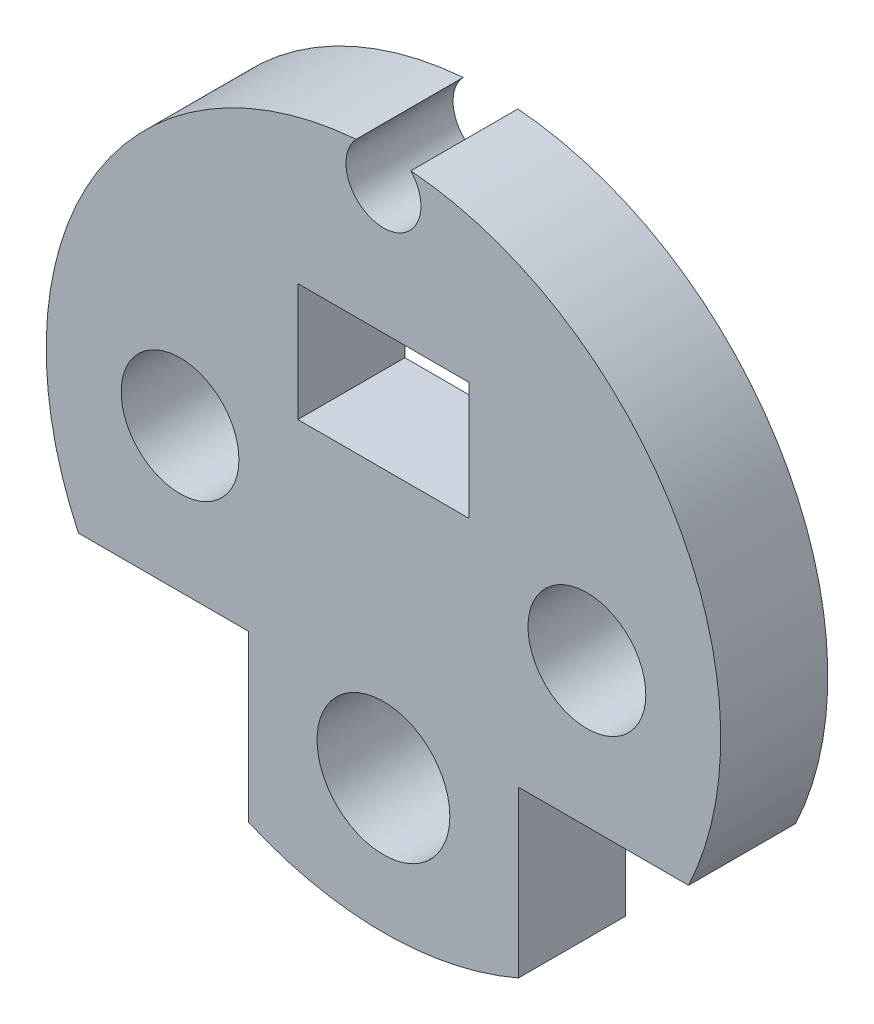
ISO-10303-21;
HEADER;
FILE_DESCRIPTION(('STEP AP214'),'2;1');
FILE_NAME('part.step','',(''),(''),'','','');
FILE_SCHEMA(('AUTOMOTIVE_DESIGN { 1 0 10303 214 1 1 1 1 }'));
ENDSEC;
DATA;
#1=APPLICATION_CONTEXT('core data for automotive mechanical design processes');
#2=APPLICATION_PROTOCOL_DEFINITION('international standard','automotive_design',2000,#1);
#3=PRODUCT_CONTEXT('',#1,'mechanical');
#4=PRODUCT('Part','Part','',(#3));
#5=PRODUCT_RELATED_PRODUCT_CATEGORY('part','',(#4));
#6=PRODUCT_DEFINITION_FORMATION('','',#4);
#7=PRODUCT_DEFINITION_CONTEXT('part definition',#1,'design');
#8=PRODUCT_DEFINITION('design','',#6,#7);
#9=PRODUCT_DEFINITION_SHAPE('','',#8);
#10=(LENGTH_UNIT() NAMED_UNIT(*) SI_UNIT(.MILLI.,.METRE.));
#11=(NAMED_UNIT(*) PLANE_ANGLE_UNIT() SI_UNIT($,.RADIAN.));
#12=(NAMED_UNIT(*) SI_UNIT($,.STERADIAN.) SOLID_ANGLE_UNIT());
#13=UNCERTAINTY_MEASURE_WITH_UNIT(LENGTH_MEASURE(1.E-05),#10,'distance_accuracy_value','');
#14=(GEOMETRIC_REPRESENTATION_CONTEXT(3) GLOBAL_UNCERTAINTY_ASSIGNED_CONTEXT((#13)) GLOBAL_UNIT_ASSIGNED_CONTEXT((#10,
#11,#12)) REPRESENTATION_CONTEXT('',''));
#15=CARTESIAN_POINT('',(0.,0.,0.));
#16=DIRECTION('',(0.,0.,1.));
#17=DIRECTION('',(1.,0.,0.));
#18=AXIS2_PLACEMENT_3D('',#15,#16,#17);
#19=CARTESIAN_POINT('',(0.,0.,5.));
#20=DIRECTION('',(0.,0.,-1.));
#21=DIRECTION('',(-1.,0.,0.));
#22=AXIS2_PLACEMENT_3D('',#19,#20,#21);
#23=CYLINDRICAL_SURFACE('',#22,15.75);
#24=DIRECTION('',(0.,0.,1.));
#25=VECTOR('',#24,1.);
#26=CARTESIAN_POINT('',(6.30417815305591,-14.4332892236847,0.));
#27=LINE('',#26,#25);
#28=CARTESIAN_POINT('',(6.30417815305591,-14.4332892236847,0.));
#29=VERTEX_POINT('',#28);
#30=CARTESIAN_POINT('',(6.30417815305591,-14.4332892236847,5.));
#31=VERTEX_POINT('',#30);
#32=EDGE_CURVE('E197',#29,#31,#27,.T.);
#33=ORIENTED_EDGE('',*,*,#32,.T.);
#34=CARTESIAN_POINT('',(0.,0.,5.));
#35=DIRECTION('',(0.,0.,1.));
#36=DIRECTION('',(1.,0.,0.));
#37=AXIS2_PLACEMENT_3D('',#34,#35,#36);
#38=CIRCLE('',#37,15.75);
#39=CARTESIAN_POINT('',(-6.30417815305591,-14.4332892236847,5.));
#40=VERTEX_POINT('',#39);
#41=EDGE_CURVE('E279',#40,#31,#38,.T.);
#42=ORIENTED_EDGE('',*,*,#41,.F.);
#43=DIRECTION('',(0.,0.,1.));
#44=VECTOR('',#43,1.);
#45=CARTESIAN_POINT('',(-6.30417815305591,-14.4332892236847,0.));
#46=LINE('',#45,#44);
#47=CARTESIAN_POINT('',(-6.30417815305591,-14.4332892236847,0.));
#48=VERTEX_POINT('',#47);
#49=EDGE_CURVE('E211',#48,#40,#46,.T.);
#50=ORIENTED_EDGE('',*,*,#49,.F.);
#51=CARTESIAN_POINT('',(0.,0.,0.));
#52=DIRECTION('',(0.,0.,1.));
#53=DIRECTION('',(1.,0.,0.));
#54=AXIS2_PLACEMENT_3D('',#51,#52,#53);
#55=CIRCLE('',#54,15.75);
#56=CARTESIAN_POINT('',(-2.75,-15.5080624192708,0.));
#57=VERTEX_POINT('',#56);
#58=EDGE_CURVE('E275',#48,#57,#55,.T.);
#59=ORIENTED_EDGE('',*,*,#58,.T.);
#60=DIRECTION('',(0.,0.,-1.));
#61=VECTOR('',#60,1.);
#62=CARTESIAN_POINT('',(-2.75,-15.5080624192708,5.));
#63=LINE('',#62,#61);
#64=CARTESIAN_POINT('',(-2.75,-15.5080624192708,2.7));
#65=VERTEX_POINT('',#64);
#66=EDGE_CURVE('E272',#57,#65,#63,.F.);
#67=ORIENTED_EDGE('',*,*,#66,.T.);
#68=CARTESIAN_POINT('',(0.,0.,2.7));
#69=DIRECTION('',(0.,0.,1.));
#70=DIRECTION('',(1.,0.,0.));
#71=AXIS2_PLACEMENT_3D('',#68,#69,#70);
#72=CIRCLE('',#71,15.75);
#73=CARTESIAN_POINT('',(2.75,-15.5080624192708,2.7));
#74=VERTEX_POINT('',#73);
#75=EDGE_CURVE('E44',#65,#74,#72,.T.);
#76=ORIENTED_EDGE('',*,*,#75,.T.);
#77=DIRECTION('',(0.,0.,-1.));
#78=VECTOR('',#77,1.);
#79=CARTESIAN_POINT('',(2.75,-15.5080624192708,5.));
#80=LINE('',#79,#78);
#81=CARTESIAN_POINT('',(2.75,-15.5080624192708,0.));
#82=VERTEX_POINT('',#81);
#83=EDGE_CURVE('E269',#74,#82,#80,.T.);
#84=ORIENTED_EDGE('',*,*,#83,.T.);
#85=EDGE_CURVE('E281',#82,#29,#55,.T.);
#86=ORIENTED_EDGE('',*,*,#85,.T.);
#87=EDGE_LOOP('',(#33,#42,#50,#59,#67,#76,#84,#86));
#88=FACE_BOUND('',#87,.T.);
#89=ADVANCED_FACE('F37',(#88),#23,.T.);
#90=DIRECTION('',(0.,0.,1.));
#91=VECTOR('',#90,1.);
#92=CARTESIAN_POINT('',(14.2466739913557,-6.71526471436738,0.));
#93=LINE('',#92,#91);
#94=CARTESIAN_POINT('',(14.2466739913557,-6.71526471436738,0.));
#95=VERTEX_POINT('',#94);
#96=CARTESIAN_POINT('',(14.2466739913557,-6.71526471436738,5.));
#97=VERTEX_POINT('',#96);
#98=EDGE_CURVE('E192',#95,#97,#93,.T.);
#99=ORIENTED_EDGE('',*,*,#98,.F.);
#100=CARTESIAN_POINT('',(1.27539600061427,15.698275862069,0.));
#101=VERTEX_POINT('',#100);
#102=EDGE_CURVE('E283',#95,#101,#55,.T.);
#103=ORIENTED_EDGE('',*,*,#102,.T.);
#104=DIRECTION('',(0.,0.,1.));
#105=VECTOR('',#104,1.);
#106=CARTESIAN_POINT('',(1.27539600061426,15.698275862069,2.5));
#107=LINE('',#106,#105);
#108=CARTESIAN_POINT('',(1.27539600061426,15.698275862069,5.));
#109=VERTEX_POINT('',#108);
#110=EDGE_CURVE('E245',#101,#109,#107,.T.);
#111=ORIENTED_EDGE('',*,*,#110,.T.);
#112=EDGE_CURVE('E280',#97,#109,#38,.T.);
#113=ORIENTED_EDGE('',*,*,#112,.F.);
#114=EDGE_LOOP('',(#99,#103,#111,#113));
#115=FACE_BOUND('',#114,.T.);
#116=ADVANCED_FACE('F323',(#115),#23,.T.);
#117=CARTESIAN_POINT('',(0.,0.,5.));
#118=DIRECTION('',(0.,0.,1.));
#119=DIRECTION('',(1.,0.,0.));
#120=AXIS2_PLACEMENT_3D('',#117,#118,#119);
#121=PLANE('',#120);
#122=DIRECTION('',(0.,-1.,0.));
#123=VECTOR('',#122,1.);
#124=CARTESIAN_POINT('',(-4.,8.5,5.));
#125=LINE('',#124,#123);
#126=CARTESIAN_POINT('',(-4.,8.5,5.));
#127=VERTEX_POINT('',#126);
#128=CARTESIAN_POINT('',(-4.,3.,5.));
#129=VERTEX_POINT('',#128);
#130=EDGE_CURVE('E51',#127,#129,#125,.T.);
#131=ORIENTED_EDGE('',*,*,#130,.F.);
#132=DIRECTION('',(-1.,0.,0.));
#133=VECTOR('',#132,1.);
#134=CARTESIAN_POINT('',(-4.,8.5,5.));
#135=LINE('',#134,#133);
#136=CARTESIAN_POINT('',(4.,8.5,5.));
#137=VERTEX_POINT('',#136);
#138=EDGE_CURVE('E167',#137,#127,#135,.T.);
#139=ORIENTED_EDGE('',*,*,#138,.F.);
#140=DIRECTION('',(0.,1.,0.));
#141=VECTOR('',#140,1.);
#142=CARTESIAN_POINT('',(4.,8.5,5.));
#143=LINE('',#142,#141);
#144=CARTESIAN_POINT('',(4.,3.,5.));
#145=VERTEX_POINT('',#144);
#146=EDGE_CURVE('E170',#145,#137,#143,.T.);
#147=ORIENTED_EDGE('',*,*,#146,.F.);
#148=DIRECTION('',(1.,0.,0.));
#149=VECTOR('',#148,1.);
#150=CARTESIAN_POINT('',(-4.,3.,5.));
#151=LINE('',#150,#149);
#152=EDGE_CURVE('E176',#129,#145,#151,.T.);
#153=ORIENTED_EDGE('',*,*,#152,.F.);
#154=EDGE_LOOP('',(#131,#139,#147,#153));
#155=FACE_BOUND('',#154,.T.);
#156=CARTESIAN_POINT('',(9.5,0.,5.));
#157=DIRECTION('',(0.,0.,1.));
#158=DIRECTION('',(1.,0.,0.));
#159=AXIS2_PLACEMENT_3D('',#156,#157,#158);
#160=CIRCLE('',#159,2.75);
#161=CARTESIAN_POINT('',(12.25,0.,5.));
#162=VERTEX_POINT('',#161);
#163=EDGE_CURVE('E231',#162,#162,#160,.T.);
#164=ORIENTED_EDGE('',*,*,#163,.F.);
#165=EDGE_LOOP('',(#164));
#166=FACE_BOUND('',#165,.T.);
#167=CARTESIAN_POINT('',(-9.5,0.,5.));
#168=DIRECTION('',(0.,0.,1.));
#169=DIRECTION('',(1.,0.,0.));
#170=AXIS2_PLACEMENT_3D('',#167,#168,#169);
#171=CIRCLE('',#170,2.75);
#172=CARTESIAN_POINT('',(-6.75,0.,5.));
#173=VERTEX_POINT('',#172);
#174=EDGE_CURVE('E225',#173,#173,#171,.T.);
#175=ORIENTED_EDGE('',*,*,#174,.F.);
#176=EDGE_LOOP('',(#175));
#177=FACE_BOUND('',#176,.T.);
#178=CARTESIAN_POINT('',(0.,-9.50000000000001,5.));
#179=DIRECTION('',(0.,0.,1.));
#180=DIRECTION('',(1.,0.,0.));
#181=AXIS2_PLACEMENT_3D('',#178,#179,#180);
#182=CIRCLE('',#181,3.1);
#183=CARTESIAN_POINT('',(3.1,-9.50000000000001,5.));
#184=VERTEX_POINT('',#183);
#185=EDGE_CURVE('E218',#184,#184,#182,.T.);
#186=ORIENTED_EDGE('',*,*,#185,.F.);
#187=EDGE_LOOP('',(#186));
#188=FACE_BOUND('',#187,.T.);
#189=ORIENTED_EDGE('',*,*,#41,.T.);
#190=DIRECTION('',(0.,1.,0.));
#191=VECTOR('',#190,1.);
#192=CARTESIAN_POINT('',(6.30417815305591,-6.71526471436738,5.));
#193=LINE('',#192,#191);
#194=CARTESIAN_POINT('',(6.30417815305591,-6.71526471436738,5.));
#195=VERTEX_POINT('',#194);
#196=EDGE_CURVE('E189',#31,#195,#193,.T.);
#197=ORIENTED_EDGE('',*,*,#196,.T.);
#198=DIRECTION('',(1.,0.,0.));
#199=VECTOR('',#198,1.);
#200=CARTESIAN_POINT('',(14.2466739913557,-6.71526471436738,5.));
#201=LINE('',#200,#199);
#202=EDGE_CURVE('E182',#195,#97,#201,.T.);
#203=ORIENTED_EDGE('',*,*,#202,.T.);
#204=ORIENTED_EDGE('',*,*,#112,.T.);
#205=CARTESIAN_POINT('',(0.,14.5,5.));
#206=DIRECTION('',(0.,0.,1.));
#207=DIRECTION('',(1.,0.,0.));
#208=AXIS2_PLACEMENT_3D('',#205,#206,#207);
#209=CIRCLE('',#208,1.75);
#210=CARTESIAN_POINT('',(-1.27539600061427,15.698275862069,5.));
#211=VERTEX_POINT('',#210);
#212=EDGE_CURVE('E237',#211,#109,#209,.T.);
#213=ORIENTED_EDGE('',*,*,#212,.F.);
#214=CARTESIAN_POINT('',(-14.2466739913557,-6.71526471436738,5.));
#215=VERTEX_POINT('',#214);
#216=EDGE_CURVE('E276',#211,#215,#38,.T.);
#217=ORIENTED_EDGE('',*,*,#216,.T.);
#218=DIRECTION('',(-1.,0.,0.));
#219=VECTOR('',#218,1.);
#220=CARTESIAN_POINT('',(-14.2466739913557,-6.71526471436738,5.));
#221=LINE('',#220,#219);
#222=CARTESIAN_POINT('',(-6.30417815305591,-6.71526471436738,5.));
#223=VERTEX_POINT('',#222);
#224=EDGE_CURVE('E208',#223,#215,#221,.T.);
#225=ORIENTED_EDGE('',*,*,#224,.F.);
#226=DIRECTION('',(0.,1.,0.));
#227=VECTOR('',#226,1.);
#228=CARTESIAN_POINT('',(-6.30417815305591,-6.71526471436738,5.));
#229=LINE('',#228,#227);
#230=EDGE_CURVE('E200',#40,#223,#229,.T.);
#231=ORIENTED_EDGE('',*,*,#230,.F.);
#232=EDGE_LOOP('',(#189,#197,#203,#204,#213,#217,#225,#231));
#233=FACE_BOUND('',#232,.T.);
#234=ADVANCED_FACE('F312',(#155,#166,#177,#188,#233),#121,.T.);
#235=CARTESIAN_POINT('',(0.,0.,0.));
#236=DIRECTION('',(0.,0.,1.));
#237=DIRECTION('',(1.,0.,0.));
#238=AXIS2_PLACEMENT_3D('',#235,#236,#237);
#239=PLANE('',#238);
#240=DIRECTION('',(-1.,0.,0.));
#241=VECTOR('',#240,1.);
#242=CARTESIAN_POINT('',(-4.,8.5,0.));
#243=LINE('',#242,#241);
#244=CARTESIAN_POINT('',(4.,8.5,0.));
#245=VERTEX_POINT('',#244);
#246=CARTESIAN_POINT('',(-4.,8.5,0.));
#247=VERTEX_POINT('',#246);
#248=EDGE_CURVE('E157',#245,#247,#243,.T.);
#249=ORIENTED_EDGE('',*,*,#248,.T.);
#250=DIRECTION('',(0.,-1.,0.));
#251=VECTOR('',#250,1.);
#252=CARTESIAN_POINT('',(-4.,8.5,0.));
#253=LINE('',#252,#251);
#254=CARTESIAN_POINT('',(-4.,3.,0.));
#255=VERTEX_POINT('',#254);
#256=EDGE_CURVE('E151',#247,#255,#253,.T.);
#257=ORIENTED_EDGE('',*,*,#256,.T.);
#258=DIRECTION('',(1.,0.,0.));
#259=VECTOR('',#258,1.);
#260=CARTESIAN_POINT('',(-4.,3.,0.));
#261=LINE('',#260,#259);
#262=CARTESIAN_POINT('',(4.,3.,0.));
#263=VERTEX_POINT('',#262);
#264=EDGE_CURVE('E160',#255,#263,#261,.T.);
#265=ORIENTED_EDGE('',*,*,#264,.T.);
#266=DIRECTION('',(0.,1.,0.));
#267=VECTOR('',#266,1.);
#268=CARTESIAN_POINT('',(4.,8.5,0.));
#269=LINE('',#268,#267);
#270=EDGE_CURVE('E59',#263,#245,#269,.T.);
#271=ORIENTED_EDGE('',*,*,#270,.T.);
#272=EDGE_LOOP('',(#249,#257,#265,#271));
#273=FACE_BOUND('',#272,.T.);
#274=CARTESIAN_POINT('',(9.5,0.,0.));
#275=DIRECTION('',(0.,0.,1.));
#276=DIRECTION('',(1.,0.,0.));
#277=AXIS2_PLACEMENT_3D('',#274,#275,#276);
#278=CIRCLE('',#277,2.75);
#279=CARTESIAN_POINT('',(12.25,0.,0.));
#280=VERTEX_POINT('',#279);
#281=EDGE_CURVE('E234',#280,#280,#278,.T.);
#282=ORIENTED_EDGE('',*,*,#281,.T.);
#283=EDGE_LOOP('',(#282));
#284=FACE_BOUND('',#283,.T.);
#285=CARTESIAN_POINT('',(-9.5,0.,0.));
#286=DIRECTION('',(0.,0.,1.));
#287=DIRECTION('',(1.,0.,0.));
#288=AXIS2_PLACEMENT_3D('',#285,#286,#287);
#289=CIRCLE('',#288,2.75);
#290=CARTESIAN_POINT('',(-6.75,0.,0.));
#291=VERTEX_POINT('',#290);
#292=EDGE_CURVE('E228',#291,#291,#289,.T.);
#293=ORIENTED_EDGE('',*,*,#292,.T.);
#294=EDGE_LOOP('',(#293));
#295=FACE_BOUND('',#294,.T.);
#296=CARTESIAN_POINT('',(0.,-9.50000000000001,0.));
#297=DIRECTION('',(0.,0.,1.));
#298=DIRECTION('',(1.,0.,0.));
#299=AXIS2_PLACEMENT_3D('',#296,#297,#298);
#300=CIRCLE('',#299,3.1);
#301=CARTESIAN_POINT('',(3.1,-9.50000000000001,0.));
#302=VERTEX_POINT('',#301);
#303=EDGE_CURVE('E222',#302,#302,#300,.T.);
#304=ORIENTED_EDGE('',*,*,#303,.T.);
#305=EDGE_LOOP('',(#304));
#306=FACE_BOUND('',#305,.T.);
#307=DIRECTION('',(0.,1.,0.));
#308=VECTOR('',#307,1.);
#309=CARTESIAN_POINT('',(6.30417815305591,-6.71526471436738,0.));
#310=LINE('',#309,#308);
#311=CARTESIAN_POINT('',(6.30417815305591,-6.71526471436738,0.));
#312=VERTEX_POINT('',#311);
#313=EDGE_CURVE('E188',#29,#312,#310,.T.);
#314=ORIENTED_EDGE('',*,*,#313,.F.);
#315=ORIENTED_EDGE('',*,*,#85,.F.);
#316=DIRECTION('',(0.,-1.,0.));
#317=VECTOR('',#316,1.);
#318=CARTESIAN_POINT('',(2.75,-13.5149299483471,0.));
#319=LINE('',#318,#317);
#320=CARTESIAN_POINT('',(2.75,-16.5,0.));
#321=VERTEX_POINT('',#320);
#322=EDGE_CURVE('E248',#82,#321,#319,.T.);
#323=ORIENTED_EDGE('',*,*,#322,.T.);
#324=DIRECTION('',(-1.,0.,0.));
#325=VECTOR('',#324,1.);
#326=CARTESIAN_POINT('',(2.75,-16.5,0.));
#327=LINE('',#326,#325);
#328=CARTESIAN_POINT('',(-2.75,-16.5,0.));
#329=VERTEX_POINT('',#328);
#330=EDGE_CURVE('E253',#321,#329,#327,.T.);
#331=ORIENTED_EDGE('',*,*,#330,.T.);
#332=DIRECTION('',(0.,1.,0.));
#333=VECTOR('',#332,1.);
#334=CARTESIAN_POINT('',(-2.75,-13.5149299483471,0.));
#335=LINE('',#334,#333);
#336=EDGE_CURVE('E249',#329,#57,#335,.T.);
#337=ORIENTED_EDGE('',*,*,#336,.T.);
#338=ORIENTED_EDGE('',*,*,#58,.F.);
#339=DIRECTION('',(0.,1.,0.));
#340=VECTOR('',#339,1.);
#341=CARTESIAN_POINT('',(-6.30417815305591,-6.71526471436738,0.));
#342=LINE('',#341,#340);
#343=CARTESIAN_POINT('',(-6.30417815305591,-6.71526471436738,0.));
#344=VERTEX_POINT('',#343);
#345=EDGE_CURVE('E204',#48,#344,#342,.T.);
#346=ORIENTED_EDGE('',*,*,#345,.T.);
#347=DIRECTION('',(-1.,0.,0.));
#348=VECTOR('',#347,1.);
#349=CARTESIAN_POINT('',(-14.2466739913557,-6.71526471436738,0.));
#350=LINE('',#349,#348);
#351=CARTESIAN_POINT('',(-14.2466739913557,-6.71526471436738,0.));
#352=VERTEX_POINT('',#351);
#353=EDGE_CURVE('E207',#344,#352,#350,.T.);
#354=ORIENTED_EDGE('',*,*,#353,.T.);
#355=CARTESIAN_POINT('',(-1.27539600061427,15.698275862069,0.));
#356=VERTEX_POINT('',#355);
#357=EDGE_CURVE('E284',#356,#352,#55,.T.);
#358=ORIENTED_EDGE('',*,*,#357,.F.);
#359=CARTESIAN_POINT('',(0.,14.5,0.));
#360=DIRECTION('',(0.,0.,1.));
#361=DIRECTION('',(1.,0.,0.));
#362=AXIS2_PLACEMENT_3D('',#359,#360,#361);
#363=CIRCLE('',#362,1.75);
#364=EDGE_CURVE('E12',#356,#101,#363,.T.);
#365=ORIENTED_EDGE('',*,*,#364,.T.);
#366=ORIENTED_EDGE('',*,*,#102,.F.);
#367=DIRECTION('',(1.,0.,0.));
#368=VECTOR('',#367,1.);
#369=CARTESIAN_POINT('',(14.2466739913557,-6.71526471436738,0.));
#370=LINE('',#369,#368);
#371=EDGE_CURVE('E186',#312,#95,#370,.T.);
#372=ORIENTED_EDGE('',*,*,#371,.F.);
#373=EDGE_LOOP('',(#314,#315,#323,#331,#337,#338,#346,#354,#358,#365,#366,#372));
#374=FACE_BOUND('',#373,.T.);
#375=ADVANCED_FACE('F164',(#273,#284,#295,#306,#374),#239,.F.);
#376=ORIENTED_EDGE('',*,*,#357,.T.);
#377=DIRECTION('',(0.,0.,1.));
#378=VECTOR('',#377,1.);
#379=CARTESIAN_POINT('',(-14.2466739913557,-6.71526471436738,0.));
#380=LINE('',#379,#378);
#381=EDGE_CURVE('E215',#352,#215,#380,.T.);
#382=ORIENTED_EDGE('',*,*,#381,.T.);
#383=ORIENTED_EDGE('',*,*,#216,.F.);
#384=DIRECTION('',(0.,0.,1.));
#385=VECTOR('',#384,1.);
#386=CARTESIAN_POINT('',(-1.27539600061427,15.698275862069,2.5));
#387=LINE('',#386,#385);
#388=EDGE_CURVE('E242',#211,#356,#387,.F.);
#389=ORIENTED_EDGE('',*,*,#388,.T.);
#390=EDGE_LOOP('',(#376,#382,#383,#389));
#391=FACE_BOUND('',#390,.T.);
#392=ADVANCED_FACE('F334',(#391),#23,.T.);
#393=CARTESIAN_POINT('',(0.,0.,2.7));
#394=DIRECTION('',(0.,0.,1.));
#395=DIRECTION('',(1.,0.,0.));
#396=AXIS2_PLACEMENT_3D('',#393,#394,#395);
#397=PLANE('',#396);
#398=ORIENTED_EDGE('',*,*,#75,.F.);
#399=DIRECTION('',(0.,1.,0.));
#400=VECTOR('',#399,1.);
#401=CARTESIAN_POINT('',(-2.75,-13.5149299483471,2.7));
#402=LINE('',#401,#400);
#403=CARTESIAN_POINT('',(-2.75,-16.5,2.7));
#404=VERTEX_POINT('',#403);
#405=EDGE_CURVE('E263',#404,#65,#402,.T.);
#406=ORIENTED_EDGE('',*,*,#405,.F.);
#407=DIRECTION('',(-1.,0.,0.));
#408=VECTOR('',#407,1.);
#409=CARTESIAN_POINT('',(2.75,-16.5,2.7));
#410=LINE('',#409,#408);
#411=CARTESIAN_POINT('',(2.75,-16.5,2.7));
#412=VERTEX_POINT('',#411);
#413=EDGE_CURVE('E252',#412,#404,#410,.T.);
#414=ORIENTED_EDGE('',*,*,#413,.F.);
#415=DIRECTION('',(0.,-1.,0.));
#416=VECTOR('',#415,1.);
#417=CARTESIAN_POINT('',(2.75,-13.5149299483471,2.7));
#418=LINE('',#417,#416);
#419=EDGE_CURVE('E260',#74,#412,#418,.T.);
#420=ORIENTED_EDGE('',*,*,#419,.F.);
#421=EDGE_LOOP('',(#398,#406,#414,#420));
#422=FACE_BOUND('',#421,.T.);
#423=ADVANCED_FACE('F291',(#422),#397,.T.);
#424=CARTESIAN_POINT('',(-2.75,-13.5149299483471,11.2578465316174));
#425=DIRECTION('',(-1.,0.,0.));
#426=DIRECTION('',(0.,-1.,0.));
#427=AXIS2_PLACEMENT_3D('',#424,#425,#426);
#428=PLANE('',#427);
#429=ORIENTED_EDGE('',*,*,#66,.F.);
#430=ORIENTED_EDGE('',*,*,#336,.F.);
#431=DIRECTION('',(0.,0.,-1.));
#432=VECTOR('',#431,1.);
#433=CARTESIAN_POINT('',(-2.75,-16.5,11.2578465316174));
#434=LINE('',#433,#432);
#435=EDGE_CURVE('E259',#404,#329,#434,.T.);
#436=ORIENTED_EDGE('',*,*,#435,.F.);
#437=ORIENTED_EDGE('',*,*,#405,.T.);
#438=EDGE_LOOP('',(#429,#430,#436,#437));
#439=FACE_BOUND('',#438,.T.);
#440=ADVANCED_FACE('F295',(#439),#428,.T.);
#441=CARTESIAN_POINT('',(2.75,-13.5149299483471,11.2578465316174));
#442=DIRECTION('',(1.,0.,0.));
#443=DIRECTION('',(0.,1.,0.));
#444=AXIS2_PLACEMENT_3D('',#441,#442,#443);
#445=PLANE('',#444);
#446=ORIENTED_EDGE('',*,*,#83,.F.);
#447=ORIENTED_EDGE('',*,*,#419,.T.);
#448=DIRECTION('',(0.,0.,-1.));
#449=VECTOR('',#448,1.);
#450=CARTESIAN_POINT('',(2.75,-16.5,11.2578465316174));
#451=LINE('',#450,#449);
#452=EDGE_CURVE('E262',#412,#321,#451,.T.);
#453=ORIENTED_EDGE('',*,*,#452,.T.);
#454=ORIENTED_EDGE('',*,*,#322,.F.);
#455=EDGE_LOOP('',(#446,#447,#453,#454));
#456=FACE_BOUND('',#455,.T.);
#457=ADVANCED_FACE('F302',(#456),#445,.T.);
#458=CARTESIAN_POINT('',(2.75,-16.5,11.2578465316174));
#459=DIRECTION('',(0.,-1.,0.));
#460=DIRECTION('',(0.,0.,-1.));
#461=AXIS2_PLACEMENT_3D('',#458,#459,#460);
#462=PLANE('',#461);
#463=ORIENTED_EDGE('',*,*,#452,.F.);
#464=ORIENTED_EDGE('',*,*,#413,.T.);
#465=ORIENTED_EDGE('',*,*,#435,.T.);
#466=ORIENTED_EDGE('',*,*,#330,.F.);
#467=EDGE_LOOP('',(#463,#464,#465,#466));
#468=FACE_BOUND('',#467,.T.);
#469=ADVANCED_FACE('F300',(#468),#462,.T.);
#470=CARTESIAN_POINT('',(0.,14.5,0.));
#471=DIRECTION('',(0.,0.,1.));
#472=DIRECTION('',(1.,0.,0.));
#473=AXIS2_PLACEMENT_3D('',#470,#471,#472);
#474=CYLINDRICAL_SURFACE('',#473,1.75);
#475=ORIENTED_EDGE('',*,*,#364,.F.);
#476=ORIENTED_EDGE('',*,*,#388,.F.);
#477=ORIENTED_EDGE('',*,*,#212,.T.);
#478=ORIENTED_EDGE('',*,*,#110,.F.);
#479=EDGE_LOOP('',(#475,#476,#477,#478));
#480=FACE_BOUND('',#479,.T.);
#481=ADVANCED_FACE('F322',(#480),#474,.F.);
#482=CARTESIAN_POINT('',(9.5,0.,0.));
#483=DIRECTION('',(0.,0.,1.));
#484=DIRECTION('',(1.,0.,0.));
#485=AXIS2_PLACEMENT_3D('',#482,#483,#484);
#486=CYLINDRICAL_SURFACE('',#485,2.75);
#487=ORIENTED_EDGE('',*,*,#281,.F.);
#488=EDGE_LOOP('',(#487));
#489=FACE_BOUND('',#488,.T.);
#490=ORIENTED_EDGE('',*,*,#163,.T.);
#491=EDGE_LOOP('',(#490));
#492=FACE_BOUND('',#491,.T.);
#493=ADVANCED_FACE('F364',(#489,#492),#486,.F.);
#494=CARTESIAN_POINT('',(-9.5,0.,0.));
#495=DIRECTION('',(0.,0.,1.));
#496=DIRECTION('',(1.,0.,0.));
#497=AXIS2_PLACEMENT_3D('',#494,#495,#496);
#498=CYLINDRICAL_SURFACE('',#497,2.75);
#499=ORIENTED_EDGE('',*,*,#292,.F.);
#500=EDGE_LOOP('',(#499));
#501=FACE_BOUND('',#500,.T.);
#502=ORIENTED_EDGE('',*,*,#174,.T.);
#503=EDGE_LOOP('',(#502));
#504=FACE_BOUND('',#503,.T.);
#505=ADVANCED_FACE('F367',(#501,#504),#498,.F.);
#506=CARTESIAN_POINT('',(0.,-9.50000000000001,0.));
#507=DIRECTION('',(0.,0.,1.));
#508=DIRECTION('',(1.,0.,0.));
#509=AXIS2_PLACEMENT_3D('',#506,#507,#508);
#510=CYLINDRICAL_SURFACE('',#509,3.1);
#511=ORIENTED_EDGE('',*,*,#303,.F.);
#512=EDGE_LOOP('',(#511));
#513=FACE_BOUND('',#512,.T.);
#514=ORIENTED_EDGE('',*,*,#185,.T.);
#515=EDGE_LOOP('',(#514));
#516=FACE_BOUND('',#515,.T.);
#517=ADVANCED_FACE('F371',(#513,#516),#510,.F.);
#518=CARTESIAN_POINT('',(-14.2466739913557,-6.71526471436738,0.));
#519=DIRECTION('',(0.,1.,0.));
#520=DIRECTION('',(0.,0.,1.));
#521=AXIS2_PLACEMENT_3D('',#518,#519,#520);
#522=PLANE('',#521);
#523=ORIENTED_EDGE('',*,*,#224,.T.);
#524=ORIENTED_EDGE('',*,*,#381,.F.);
#525=ORIENTED_EDGE('',*,*,#353,.F.);
#526=DIRECTION('',(0.,0.,1.));
#527=VECTOR('',#526,1.);
#528=CARTESIAN_POINT('',(-6.30417815305591,-6.71526471436738,0.));
#529=LINE('',#528,#527);
#530=EDGE_CURVE('E219',#344,#223,#529,.T.);
#531=ORIENTED_EDGE('',*,*,#530,.T.);
#532=EDGE_LOOP('',(#523,#524,#525,#531));
#533=FACE_BOUND('',#532,.T.);
#534=ADVANCED_FACE('F332',(#533),#522,.F.);
#535=CARTESIAN_POINT('',(-6.30417815305591,-6.71526471436738,0.));
#536=DIRECTION('',(1.,0.,0.));
#537=DIRECTION('',(0.,0.,-1.));
#538=AXIS2_PLACEMENT_3D('',#535,#536,#537);
#539=PLANE('',#538);
#540=ORIENTED_EDGE('',*,*,#230,.T.);
#541=ORIENTED_EDGE('',*,*,#530,.F.);
#542=ORIENTED_EDGE('',*,*,#345,.F.);
#543=ORIENTED_EDGE('',*,*,#49,.T.);
#544=EDGE_LOOP('',(#540,#541,#542,#543));
#545=FACE_BOUND('',#544,.T.);
#546=ADVANCED_FACE('F330',(#545),#539,.F.);
#547=CARTESIAN_POINT('',(6.30417815305591,-6.71526471436738,0.));
#548=DIRECTION('',(1.,0.,0.));
#549=DIRECTION('',(0.,0.,-1.));
#550=AXIS2_PLACEMENT_3D('',#547,#548,#549);
#551=PLANE('',#550);
#552=ORIENTED_EDGE('',*,*,#196,.F.);
#553=ORIENTED_EDGE('',*,*,#32,.F.);
#554=ORIENTED_EDGE('',*,*,#313,.T.);
#555=DIRECTION('',(0.,0.,1.));
#556=VECTOR('',#555,1.);
#557=CARTESIAN_POINT('',(6.30417815305591,-6.71526471436738,0.));
#558=LINE('',#557,#556);
#559=EDGE_CURVE('E201',#312,#195,#558,.T.);
#560=ORIENTED_EDGE('',*,*,#559,.T.);
#561=EDGE_LOOP('',(#552,#553,#554,#560));
#562=FACE_BOUND('',#561,.T.);
#563=ADVANCED_FACE('F378',(#562),#551,.T.);
#564=CARTESIAN_POINT('',(14.2466739913557,-6.71526471436738,0.));
#565=DIRECTION('',(0.,-1.,0.));
#566=DIRECTION('',(0.,0.,-1.));
#567=AXIS2_PLACEMENT_3D('',#564,#565,#566);
#568=PLANE('',#567);
#569=ORIENTED_EDGE('',*,*,#202,.F.);
#570=ORIENTED_EDGE('',*,*,#559,.F.);
#571=ORIENTED_EDGE('',*,*,#371,.T.);
#572=ORIENTED_EDGE('',*,*,#98,.T.);
#573=EDGE_LOOP('',(#569,#570,#571,#572));
#574=FACE_BOUND('',#573,.T.);
#575=ADVANCED_FACE('F381',(#574),#568,.T.);
#576=CARTESIAN_POINT('',(-4.,8.5,0.));
#577=DIRECTION('',(-1.,0.,0.));
#578=DIRECTION('',(0.,-1.,0.));
#579=AXIS2_PLACEMENT_3D('',#576,#577,#578);
#580=PLANE('',#579);
#581=ORIENTED_EDGE('',*,*,#130,.T.);
#582=DIRECTION('',(0.,0.,1.));
#583=VECTOR('',#582,1.);
#584=CARTESIAN_POINT('',(-4.,3.,0.));
#585=LINE('',#584,#583);
#586=EDGE_CURVE('E147',#255,#129,#585,.T.);
#587=ORIENTED_EDGE('',*,*,#586,.F.);
#588=ORIENTED_EDGE('',*,*,#256,.F.);
#589=DIRECTION('',(0.,0.,1.));
#590=VECTOR('',#589,1.);
#591=CARTESIAN_POINT('',(-4.,8.5,0.));
#592=LINE('',#591,#590);
#593=EDGE_CURVE('E180',#247,#127,#592,.T.);
#594=ORIENTED_EDGE('',*,*,#593,.T.);
#595=EDGE_LOOP('',(#581,#587,#588,#594));
#596=FACE_BOUND('',#595,.T.);
#597=ADVANCED_FACE('F149',(#596),#580,.F.);
#598=CARTESIAN_POINT('',(-4.,8.5,0.));
#599=DIRECTION('',(0.,1.,0.));
#600=DIRECTION('',(-1.,0.,0.));
#601=AXIS2_PLACEMENT_3D('',#598,#599,#600);
#602=PLANE('',#601);
#603=ORIENTED_EDGE('',*,*,#138,.T.);
#604=ORIENTED_EDGE('',*,*,#593,.F.);
#605=ORIENTED_EDGE('',*,*,#248,.F.);
#606=DIRECTION('',(0.,0.,1.));
#607=VECTOR('',#606,1.);
#608=CARTESIAN_POINT('',(4.,8.5,0.));
#609=LINE('',#608,#607);
#610=EDGE_CURVE('E183',#245,#137,#609,.T.);
#611=ORIENTED_EDGE('',*,*,#610,.T.);
#612=EDGE_LOOP('',(#603,#604,#605,#611));
#613=FACE_BOUND('',#612,.T.);
#614=ADVANCED_FACE('F389',(#613),#602,.F.);
#615=CARTESIAN_POINT('',(4.,8.5,0.));
#616=DIRECTION('',(1.,0.,0.));
#617=DIRECTION('',(0.,0.,-1.));
#618=AXIS2_PLACEMENT_3D('',#615,#616,#617);
#619=PLANE('',#618);
#620=ORIENTED_EDGE('',*,*,#146,.T.);
#621=ORIENTED_EDGE('',*,*,#610,.F.);
#622=ORIENTED_EDGE('',*,*,#270,.F.);
#623=DIRECTION('',(0.,0.,1.));
#624=VECTOR('',#623,1.);
#625=CARTESIAN_POINT('',(4.,3.,0.));
#626=LINE('',#625,#624);
#627=EDGE_CURVE('E156',#263,#145,#626,.T.);
#628=ORIENTED_EDGE('',*,*,#627,.T.);
#629=EDGE_LOOP('',(#620,#621,#622,#628));
#630=FACE_BOUND('',#629,.T.);
#631=ADVANCED_FACE('F392',(#630),#619,.F.);
#632=CARTESIAN_POINT('',(-4.,3.,0.));
#633=DIRECTION('',(0.,-1.,0.));
#634=DIRECTION('',(1.,0.,0.));
#635=AXIS2_PLACEMENT_3D('',#632,#633,#634);
#636=PLANE('',#635);
#637=ORIENTED_EDGE('',*,*,#152,.T.);
#638=ORIENTED_EDGE('',*,*,#627,.F.);
#639=ORIENTED_EDGE('',*,*,#264,.F.);
#640=ORIENTED_EDGE('',*,*,#586,.T.);
#641=EDGE_LOOP('',(#637,#638,#639,#640));
#642=FACE_BOUND('',#641,.T.);
#643=ADVANCED_FACE('F161',(#642),#636,.F.);
#644=CLOSED_SHELL('',(#89,#116,#234,#375,#392,#423,#440,#457,#469,#481,#493,#505,#517,#534,#546,
#563,#575,#597,#614,#631,#643));
#645=MANIFOLD_SOLID_BREP('B2',#644);
#646=ADVANCED_BREP_SHAPE_REPRESENTATION('',(#18,#645),#14);
#647=SHAPE_DEFINITION_REPRESENTATION(#9,#646);
ENDSEC;
END-ISO-10303-21;
